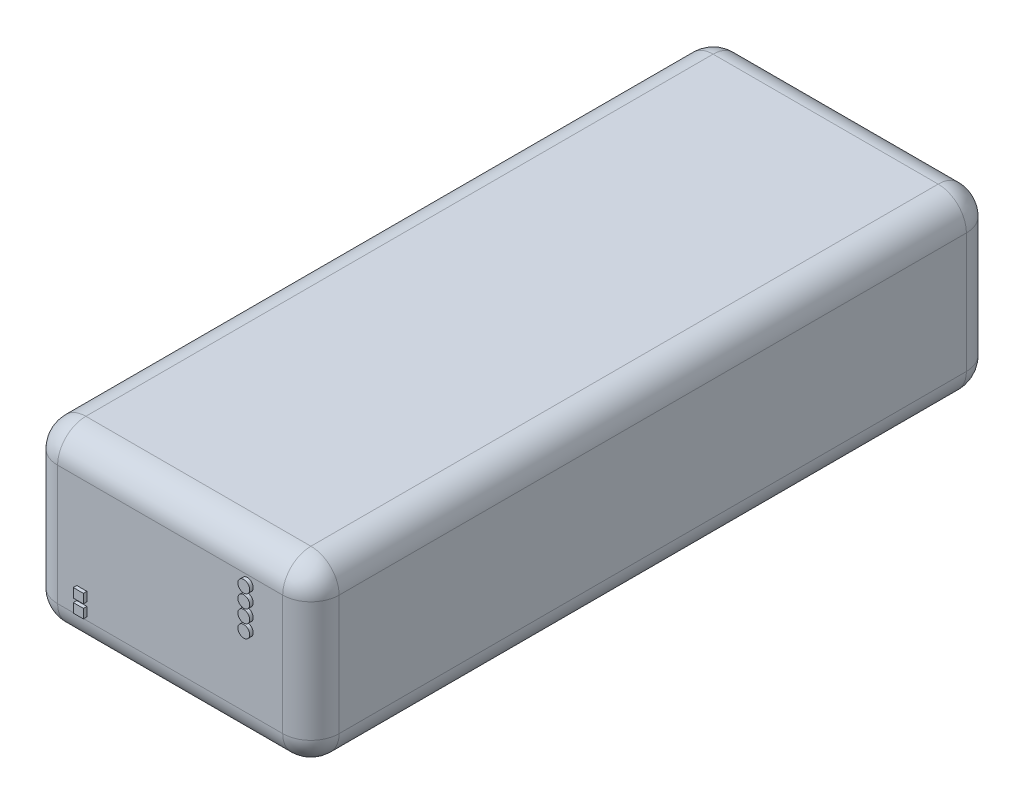
ISO-10303-21;
HEADER;
FILE_DESCRIPTION(('STEP AP214'),'2;1');
FILE_NAME('part.step','',(''),(''),'','','');
FILE_SCHEMA(('AUTOMOTIVE_DESIGN { 1 0 10303 214 1 1 1 1 }'));
ENDSEC;
DATA;
#1=APPLICATION_CONTEXT('core data for automotive mechanical design processes');
#2=APPLICATION_PROTOCOL_DEFINITION('international standard','automotive_design',2000,#1);
#3=PRODUCT_CONTEXT('',#1,'mechanical');
#4=PRODUCT('Part','Part','',(#3));
#5=PRODUCT_RELATED_PRODUCT_CATEGORY('part','',(#4));
#6=PRODUCT_DEFINITION_FORMATION('','',#4);
#7=PRODUCT_DEFINITION_CONTEXT('part definition',#1,'design');
#8=PRODUCT_DEFINITION('design','',#6,#7);
#9=PRODUCT_DEFINITION_SHAPE('','',#8);
#10=(LENGTH_UNIT() NAMED_UNIT(*) SI_UNIT(.MILLI.,.METRE.));
#11=(NAMED_UNIT(*) PLANE_ANGLE_UNIT() SI_UNIT($,.RADIAN.));
#12=(NAMED_UNIT(*) SI_UNIT($,.STERADIAN.) SOLID_ANGLE_UNIT());
#13=UNCERTAINTY_MEASURE_WITH_UNIT(LENGTH_MEASURE(1.E-05),#10,'distance_accuracy_value','');
#14=(GEOMETRIC_REPRESENTATION_CONTEXT(3) GLOBAL_UNCERTAINTY_ASSIGNED_CONTEXT((#13)) GLOBAL_UNIT_ASSIGNED_CONTEXT((#10,
#11,#12)) REPRESENTATION_CONTEXT('',''));
#15=CARTESIAN_POINT('',(0.,0.,0.));
#16=DIRECTION('',(0.,0.,1.));
#17=DIRECTION('',(1.,0.,0.));
#18=AXIS2_PLACEMENT_3D('',#15,#16,#17);
#19=CARTESIAN_POINT('',(-60.8598184671036,25.,31.1519952114924));
#20=DIRECTION('',(0.,0.,-1.));
#21=DIRECTION('',(-1.,0.,0.));
#22=AXIS2_PLACEMENT_3D('',#19,#20,#21);
#23=PLANE('',#22);
#24=DIRECTION('',(0.,-1.,0.));
#25=VECTOR('',#24,1.);
#26=CARTESIAN_POINT('',(-54.1421491003116,5.74514454988867,31.1519952114924));
#27=LINE('',#26,#25);
#28=CARTESIAN_POINT('',(-54.1421491003116,5.74514454988867,31.1519952114924));
#29=VERTEX_POINT('',#28);
#30=CARTESIAN_POINT('',(-54.1421491003116,4.44924738426584,31.1519952114924));
#31=VERTEX_POINT('',#30);
#32=EDGE_CURVE('E209',#29,#31,#27,.T.);
#33=ORIENTED_EDGE('',*,*,#32,.F.);
#34=DIRECTION('',(-1.,0.,0.));
#35=VECTOR('',#34,1.);
#36=CARTESIAN_POINT('',(-54.1421491003116,5.74514454988867,31.1519952114924));
#37=LINE('',#36,#35);
#38=CARTESIAN_POINT('',(-52.7166622181265,5.74514454988867,31.1519952114924));
#39=VERTEX_POINT('',#38);
#40=EDGE_CURVE('E214',#39,#29,#37,.T.);
#41=ORIENTED_EDGE('',*,*,#40,.F.);
#42=DIRECTION('',(0.,1.,0.));
#43=VECTOR('',#42,1.);
#44=CARTESIAN_POINT('',(-52.7166622181265,5.74514454988867,31.1519952114924));
#45=LINE('',#44,#43);
#46=CARTESIAN_POINT('',(-52.7166622181265,4.44924738426585,31.1519952114924));
#47=VERTEX_POINT('',#46);
#48=EDGE_CURVE('E226',#47,#39,#45,.T.);
#49=ORIENTED_EDGE('',*,*,#48,.F.);
#50=DIRECTION('',(1.,0.,0.));
#51=VECTOR('',#50,1.);
#52=CARTESIAN_POINT('',(-54.1421491003116,4.44924738426585,31.1519952114924));
#53=LINE('',#52,#51);
#54=EDGE_CURVE('E223',#31,#47,#53,.T.);
#55=ORIENTED_EDGE('',*,*,#54,.F.);
#56=EDGE_LOOP('',(#33,#41,#49,#55));
#57=FACE_BOUND('',#56,.T.);
#58=CARTESIAN_POINT('',(-29.9764524472873,17.9540877102445,31.1519952114924));
#59=DIRECTION('',(0.,0.,-1.));
#60=DIRECTION('',(-1.,0.,0.));
#61=AXIS2_PLACEMENT_3D('',#58,#59,#60);
#62=CIRCLE('',#61,0.836574299287982);
#63=CARTESIAN_POINT('',(-30.8130267465753,17.9540877102445,31.1519952114924));
#64=VERTEX_POINT('',#63);
#65=EDGE_CURVE('E373',#64,#64,#62,.F.);
#66=ORIENTED_EDGE('',*,*,#65,.F.);
#67=EDGE_LOOP('',(#66));
#68=FACE_BOUND('',#67,.T.);
#69=CARTESIAN_POINT('',(-29.9764524472873,19.823866424414,31.1519952114924));
#70=DIRECTION('',(0.,0.,-1.));
#71=DIRECTION('',(-1.,0.,0.));
#72=AXIS2_PLACEMENT_3D('',#69,#70,#71);
#73=CIRCLE('',#72,0.836574299287982);
#74=CARTESIAN_POINT('',(-30.8130267465753,19.823866424414,31.1519952114924));
#75=VERTEX_POINT('',#74);
#76=EDGE_CURVE('E350',#75,#75,#73,.F.);
#77=ORIENTED_EDGE('',*,*,#76,.F.);
#78=EDGE_LOOP('',(#77));
#79=FACE_BOUND('',#78,.T.);
#80=DIRECTION('',(1.,0.,0.));
#81=VECTOR('',#80,1.);
#82=CARTESIAN_POINT('',(-60.8598184671036,4.,31.1519952114924));
#83=LINE('',#82,#81);
#84=CARTESIAN_POINT('',(-56.8598184671036,4.,31.1519952114924));
#85=VERTEX_POINT('',#84);
#86=CARTESIAN_POINT('',(-24.9601635759931,4.,31.1519952114924));
#87=VERTEX_POINT('',#86);
#88=EDGE_CURVE('E252',#85,#87,#83,.T.);
#89=ORIENTED_EDGE('',*,*,#88,.T.);
#90=DIRECTION('',(0.,-1.,0.));
#91=VECTOR('',#90,1.);
#92=CARTESIAN_POINT('',(-24.9601635759931,25.,31.1519952114924));
#93=LINE('',#92,#91);
#94=CARTESIAN_POINT('',(-24.9601635759931,21.,31.1519952114924));
#95=VERTEX_POINT('',#94);
#96=EDGE_CURVE('E348',#87,#95,#93,.F.);
#97=ORIENTED_EDGE('',*,*,#96,.T.);
#98=DIRECTION('',(1.,0.,0.));
#99=VECTOR('',#98,1.);
#100=CARTESIAN_POINT('',(-60.8598184671036,21.,31.1519952114924));
#101=LINE('',#100,#99);
#102=CARTESIAN_POINT('',(-56.8598184671036,21.,31.1519952114924));
#103=VERTEX_POINT('',#102);
#104=EDGE_CURVE('E249',#95,#103,#101,.F.);
#105=ORIENTED_EDGE('',*,*,#104,.T.);
#106=DIRECTION('',(0.,-1.,0.));
#107=VECTOR('',#106,1.);
#108=CARTESIAN_POINT('',(-56.8598184671036,25.,31.1519952114924));
#109=LINE('',#108,#107);
#110=EDGE_CURVE('E346',#103,#85,#109,.T.);
#111=ORIENTED_EDGE('',*,*,#110,.T.);
#112=EDGE_LOOP('',(#89,#97,#105,#111));
#113=FACE_BOUND('',#112,.T.);
#114=CARTESIAN_POINT('',(-29.9764524472873,14.2980658429993,31.1519952114924));
#115=DIRECTION('',(0.,0.,-1.));
#116=DIRECTION('',(-1.,0.,0.));
#117=AXIS2_PLACEMENT_3D('',#114,#115,#116);
#118=CIRCLE('',#117,0.836574299287982);
#119=CARTESIAN_POINT('',(-30.8130267465753,14.2980658429993,31.1519952114924));
#120=VERTEX_POINT('',#119);
#121=EDGE_CURVE('E48',#120,#120,#118,.F.);
#122=ORIENTED_EDGE('',*,*,#121,.F.);
#123=EDGE_LOOP('',(#122));
#124=FACE_BOUND('',#123,.T.);
#125=CARTESIAN_POINT('',(-29.9764524472873,16.1447193040119,31.1519952114924));
#126=DIRECTION('',(0.,0.,-1.));
#127=DIRECTION('',(-1.,0.,0.));
#128=AXIS2_PLACEMENT_3D('',#125,#126,#127);
#129=CIRCLE('',#128,0.836574299287982);
#130=CARTESIAN_POINT('',(-30.8130267465753,16.1447193040119,31.1519952114924));
#131=VERTEX_POINT('',#130);
#132=EDGE_CURVE('E11',#131,#131,#129,.F.);
#133=ORIENTED_EDGE('',*,*,#132,.F.);
#134=EDGE_LOOP('',(#133));
#135=FACE_BOUND('',#134,.T.);
#136=DIRECTION('',(0.,-1.,0.));
#137=VECTOR('',#136,1.);
#138=CARTESIAN_POINT('',(-54.1421491003116,7.5917980109012,31.1519952114924));
#139=LINE('',#138,#137);
#140=CARTESIAN_POINT('',(-54.1421491003116,7.5917980109012,31.1519952114924));
#141=VERTEX_POINT('',#140);
#142=CARTESIAN_POINT('',(-54.1421491003116,6.29590084527837,31.1519952114924));
#143=VERTEX_POINT('',#142);
#144=EDGE_CURVE('E197',#141,#143,#139,.T.);
#145=ORIENTED_EDGE('',*,*,#144,.F.);
#146=DIRECTION('',(-1.,0.,0.));
#147=VECTOR('',#146,1.);
#148=CARTESIAN_POINT('',(-54.1421491003116,7.5917980109012,31.1519952114924));
#149=LINE('',#148,#147);
#150=CARTESIAN_POINT('',(-52.7166622181265,7.5917980109012,31.1519952114924));
#151=VERTEX_POINT('',#150);
#152=EDGE_CURVE('E194',#151,#141,#149,.T.);
#153=ORIENTED_EDGE('',*,*,#152,.F.);
#154=DIRECTION('',(0.,1.,0.));
#155=VECTOR('',#154,1.);
#156=CARTESIAN_POINT('',(-52.7166622181265,7.5917980109012,31.1519952114924));
#157=LINE('',#156,#155);
#158=CARTESIAN_POINT('',(-52.7166622181265,6.29590084527838,31.1519952114924));
#159=VERTEX_POINT('',#158);
#160=EDGE_CURVE('E60',#159,#151,#157,.T.);
#161=ORIENTED_EDGE('',*,*,#160,.F.);
#162=DIRECTION('',(1.,0.,0.));
#163=VECTOR('',#162,1.);
#164=CARTESIAN_POINT('',(-54.1421491003116,6.29590084527838,31.1519952114924));
#165=LINE('',#164,#163);
#166=EDGE_CURVE('E55',#143,#159,#165,.T.);
#167=ORIENTED_EDGE('',*,*,#166,.F.);
#168=EDGE_LOOP('',(#145,#153,#161,#167));
#169=FACE_BOUND('',#168,.T.);
#170=ADVANCED_FACE('F40',(#57,#68,#79,#113,#124,#135,#169),#23,.F.);
#171=CARTESIAN_POINT('',(-60.8598184671036,25.,-65.7471666669187));
#172=DIRECTION('',(1.,0.,0.));
#173=DIRECTION('',(0.,0.,-1.));
#174=AXIS2_PLACEMENT_3D('',#171,#172,#173);
#175=PLANE('',#174);
#176=DIRECTION('',(0.,0.,1.));
#177=VECTOR('',#176,1.);
#178=CARTESIAN_POINT('',(-60.8598184671036,21.,-65.7471666669187));
#179=LINE('',#178,#177);
#180=CARTESIAN_POINT('',(-60.8598184671036,21.,27.1519952114924));
#181=VERTEX_POINT('',#180);
#182=CARTESIAN_POINT('',(-60.8598184671036,21.,-61.7471666669187));
#183=VERTEX_POINT('',#182);
#184=EDGE_CURVE('E280',#181,#183,#179,.F.);
#185=ORIENTED_EDGE('',*,*,#184,.T.);
#186=DIRECTION('',(0.,-1.,0.));
#187=VECTOR('',#186,1.);
#188=CARTESIAN_POINT('',(-60.8598184671036,25.,-61.7471666669187));
#189=LINE('',#188,#187);
#190=CARTESIAN_POINT('',(-60.8598184671036,4.,-61.7471666669187));
#191=VERTEX_POINT('',#190);
#192=EDGE_CURVE('E336',#183,#191,#189,.T.);
#193=ORIENTED_EDGE('',*,*,#192,.T.);
#194=DIRECTION('',(0.,0.,1.));
#195=VECTOR('',#194,1.);
#196=CARTESIAN_POINT('',(-60.8598184671036,4.,-65.7471666669187));
#197=LINE('',#196,#195);
#198=CARTESIAN_POINT('',(-60.8598184671036,4.,27.1519952114924));
#199=VERTEX_POINT('',#198);
#200=EDGE_CURVE('E283',#191,#199,#197,.T.);
#201=ORIENTED_EDGE('',*,*,#200,.T.);
#202=DIRECTION('',(0.,-1.,0.));
#203=VECTOR('',#202,1.);
#204=CARTESIAN_POINT('',(-60.8598184671036,25.,27.1519952114924));
#205=LINE('',#204,#203);
#206=EDGE_CURVE('E334',#199,#181,#205,.F.);
#207=ORIENTED_EDGE('',*,*,#206,.T.);
#208=EDGE_LOOP('',(#185,#193,#201,#207));
#209=FACE_BOUND('',#208,.T.);
#210=ADVANCED_FACE('F382',(#209),#175,.F.);
#211=CARTESIAN_POINT('',(-20.9601635759931,25.,-65.7471666669187));
#212=DIRECTION('',(-1.,0.,0.));
#213=DIRECTION('',(0.,0.,1.));
#214=AXIS2_PLACEMENT_3D('',#211,#212,#213);
#215=PLANE('',#214);
#216=DIRECTION('',(0.,0.,-1.));
#217=VECTOR('',#216,1.);
#218=CARTESIAN_POINT('',(-20.9601635759931,4.,-65.7471666669187));
#219=LINE('',#218,#217);
#220=CARTESIAN_POINT('',(-20.9601635759931,4.,27.1519952114924));
#221=VERTEX_POINT('',#220);
#222=CARTESIAN_POINT('',(-20.9601635759931,4.,-61.7471666669187));
#223=VERTEX_POINT('',#222);
#224=EDGE_CURVE('E271',#221,#223,#219,.T.);
#225=ORIENTED_EDGE('',*,*,#224,.T.);
#226=DIRECTION('',(0.,-1.,0.));
#227=VECTOR('',#226,1.);
#228=CARTESIAN_POINT('',(-20.9601635759931,25.,-61.7471666669187));
#229=LINE('',#228,#227);
#230=CARTESIAN_POINT('',(-20.9601635759931,21.,-61.7471666669187));
#231=VERTEX_POINT('',#230);
#232=EDGE_CURVE('E344',#223,#231,#229,.F.);
#233=ORIENTED_EDGE('',*,*,#232,.T.);
#234=DIRECTION('',(0.,0.,-1.));
#235=VECTOR('',#234,1.);
#236=CARTESIAN_POINT('',(-20.9601635759931,21.,31.1519952114924));
#237=LINE('',#236,#235);
#238=CARTESIAN_POINT('',(-20.9601635759931,21.,27.1519952114924));
#239=VERTEX_POINT('',#238);
#240=EDGE_CURVE('E268',#231,#239,#237,.F.);
#241=ORIENTED_EDGE('',*,*,#240,.T.);
#242=DIRECTION('',(0.,-1.,0.));
#243=VECTOR('',#242,1.);
#244=CARTESIAN_POINT('',(-20.9601635759931,25.,27.1519952114924));
#245=LINE('',#244,#243);
#246=EDGE_CURVE('E342',#239,#221,#245,.T.);
#247=ORIENTED_EDGE('',*,*,#246,.T.);
#248=EDGE_LOOP('',(#225,#233,#241,#247));
#249=FACE_BOUND('',#248,.T.);
#250=ADVANCED_FACE('F477',(#249),#215,.F.);
#251=CARTESIAN_POINT('',(-60.8598184671036,25.,-65.7471666669187));
#252=DIRECTION('',(0.,0.,1.));
#253=DIRECTION('',(1.,0.,0.));
#254=AXIS2_PLACEMENT_3D('',#251,#252,#253);
#255=PLANE('',#254);
#256=DIRECTION('',(-1.,0.,0.));
#257=VECTOR('',#256,1.);
#258=CARTESIAN_POINT('',(-60.8598184671036,4.,-65.7471666669187));
#259=LINE('',#258,#257);
#260=CARTESIAN_POINT('',(-24.9601635759931,4.,-65.7471666669187));
#261=VERTEX_POINT('',#260);
#262=CARTESIAN_POINT('',(-56.8598184671036,4.,-65.7471666669187));
#263=VERTEX_POINT('',#262);
#264=EDGE_CURVE('E277',#261,#263,#259,.T.);
#265=ORIENTED_EDGE('',*,*,#264,.T.);
#266=DIRECTION('',(0.,-1.,0.));
#267=VECTOR('',#266,1.);
#268=CARTESIAN_POINT('',(-56.8598184671036,25.,-65.7471666669187));
#269=LINE('',#268,#267);
#270=CARTESIAN_POINT('',(-56.8598184671036,21.,-65.7471666669187));
#271=VERTEX_POINT('',#270);
#272=EDGE_CURVE('E340',#263,#271,#269,.F.);
#273=ORIENTED_EDGE('',*,*,#272,.T.);
#274=DIRECTION('',(-1.,0.,0.));
#275=VECTOR('',#274,1.);
#276=CARTESIAN_POINT('',(-20.9601635759931,21.,-65.7471666669187));
#277=LINE('',#276,#275);
#278=CARTESIAN_POINT('',(-24.9601635759931,21.,-65.7471666669187));
#279=VERTEX_POINT('',#278);
#280=EDGE_CURVE('E274',#271,#279,#277,.F.);
#281=ORIENTED_EDGE('',*,*,#280,.T.);
#282=DIRECTION('',(0.,-1.,0.));
#283=VECTOR('',#282,1.);
#284=CARTESIAN_POINT('',(-24.9601635759931,25.,-65.7471666669187));
#285=LINE('',#284,#283);
#286=EDGE_CURVE('E338',#279,#261,#285,.T.);
#287=ORIENTED_EDGE('',*,*,#286,.T.);
#288=EDGE_LOOP('',(#265,#273,#281,#287));
#289=FACE_BOUND('',#288,.T.);
#290=ADVANCED_FACE('F469',(#289),#255,.F.);
#291=CARTESIAN_POINT('',(0.,25.,0.));
#292=DIRECTION('',(0.,1.,0.));
#293=DIRECTION('',(0.,0.,1.));
#294=AXIS2_PLACEMENT_3D('',#291,#292,#293);
#295=PLANE('',#294);
#296=DIRECTION('',(0.,0.,-1.));
#297=VECTOR('',#296,1.);
#298=CARTESIAN_POINT('',(-24.9601635759931,25.,-65.7471666669187));
#299=LINE('',#298,#297);
#300=CARTESIAN_POINT('',(-24.9601635759931,25.,27.1519952114924));
#301=VERTEX_POINT('',#300);
#302=CARTESIAN_POINT('',(-24.9601635759931,25.,-61.7471666669187));
#303=VERTEX_POINT('',#302);
#304=EDGE_CURVE('E292',#301,#303,#299,.T.);
#305=ORIENTED_EDGE('',*,*,#304,.T.);
#306=DIRECTION('',(-1.,0.,0.));
#307=VECTOR('',#306,1.);
#308=CARTESIAN_POINT('',(-60.8598184671036,25.,-61.7471666669187));
#309=LINE('',#308,#307);
#310=CARTESIAN_POINT('',(-56.8598184671036,25.,-61.7471666669187));
#311=VERTEX_POINT('',#310);
#312=EDGE_CURVE('E295',#303,#311,#309,.T.);
#313=ORIENTED_EDGE('',*,*,#312,.T.);
#314=DIRECTION('',(0.,0.,1.));
#315=VECTOR('',#314,1.);
#316=CARTESIAN_POINT('',(-56.8598184671036,25.,31.1519952114924));
#317=LINE('',#316,#315);
#318=CARTESIAN_POINT('',(-56.8598184671036,25.,27.1519952114924));
#319=VERTEX_POINT('',#318);
#320=EDGE_CURVE('E286',#311,#319,#317,.T.);
#321=ORIENTED_EDGE('',*,*,#320,.T.);
#322=DIRECTION('',(1.,0.,0.));
#323=VECTOR('',#322,1.);
#324=CARTESIAN_POINT('',(-20.9601635759931,25.,27.1519952114924));
#325=LINE('',#324,#323);
#326=EDGE_CURVE('E289',#319,#301,#325,.T.);
#327=ORIENTED_EDGE('',*,*,#326,.T.);
#328=EDGE_LOOP('',(#305,#313,#321,#327));
#329=FACE_BOUND('',#328,.T.);
#330=ADVANCED_FACE('F465',(#329),#295,.T.);
#331=CARTESIAN_POINT('',(0.,0.,0.));
#332=DIRECTION('',(0.,1.,0.));
#333=DIRECTION('',(0.,0.,1.));
#334=AXIS2_PLACEMENT_3D('',#331,#332,#333);
#335=PLANE('',#334);
#336=DIRECTION('',(0.,0.,-1.));
#337=VECTOR('',#336,1.);
#338=CARTESIAN_POINT('',(-24.9601635759931,0.,0.));
#339=LINE('',#338,#337);
#340=CARTESIAN_POINT('',(-24.9601635759931,0.,-61.7471666669187));
#341=VERTEX_POINT('',#340);
#342=CARTESIAN_POINT('',(-24.9601635759931,0.,27.1519952114924));
#343=VERTEX_POINT('',#342);
#344=EDGE_CURVE('E262',#341,#343,#339,.F.);
#345=ORIENTED_EDGE('',*,*,#344,.T.);
#346=DIRECTION('',(1.,0.,0.));
#347=VECTOR('',#346,1.);
#348=CARTESIAN_POINT('',(0.,0.,27.1519952114924));
#349=LINE('',#348,#347);
#350=CARTESIAN_POINT('',(-56.8598184671036,0.,27.1519952114924));
#351=VERTEX_POINT('',#350);
#352=EDGE_CURVE('E265',#343,#351,#349,.F.);
#353=ORIENTED_EDGE('',*,*,#352,.T.);
#354=DIRECTION('',(0.,0.,1.));
#355=VECTOR('',#354,1.);
#356=CARTESIAN_POINT('',(-56.8598184671036,0.,0.));
#357=LINE('',#356,#355);
#358=CARTESIAN_POINT('',(-56.8598184671036,0.,-61.7471666669187));
#359=VERTEX_POINT('',#358);
#360=EDGE_CURVE('E256',#351,#359,#357,.F.);
#361=ORIENTED_EDGE('',*,*,#360,.T.);
#362=DIRECTION('',(-1.,0.,0.));
#363=VECTOR('',#362,1.);
#364=CARTESIAN_POINT('',(0.,0.,-61.7471666669187));
#365=LINE('',#364,#363);
#366=EDGE_CURVE('E259',#359,#341,#365,.F.);
#367=ORIENTED_EDGE('',*,*,#366,.T.);
#368=EDGE_LOOP('',(#345,#353,#361,#367));
#369=FACE_BOUND('',#368,.T.);
#370=ADVANCED_FACE('F468',(#369),#335,.F.);
#371=CARTESIAN_POINT('',(-60.8598184671036,4.,-61.7471666669187));
#372=DIRECTION('',(-1.,0.,0.));
#373=DIRECTION('',(0.,0.,1.));
#374=AXIS2_PLACEMENT_3D('',#371,#372,#373);
#375=CYLINDRICAL_SURFACE('',#374,4.);
#376=ORIENTED_EDGE('',*,*,#366,.F.);
#377=CARTESIAN_POINT('',(-56.8598184671036,4.,-61.7471666669187));
#378=DIRECTION('',(-1.,0.,0.));
#379=DIRECTION('',(0.,0.,1.));
#380=AXIS2_PLACEMENT_3D('',#377,#378,#379);
#381=CIRCLE('',#380,4.);
#382=EDGE_CURVE('E315',#359,#263,#381,.F.);
#383=ORIENTED_EDGE('',*,*,#382,.T.);
#384=ORIENTED_EDGE('',*,*,#264,.F.);
#385=CARTESIAN_POINT('',(-24.9601635759931,4.,-61.7471666669187));
#386=DIRECTION('',(-1.,0.,0.));
#387=DIRECTION('',(0.,0.,1.));
#388=AXIS2_PLACEMENT_3D('',#385,#386,#387);
#389=CIRCLE('',#388,4.);
#390=EDGE_CURVE('E313',#261,#341,#389,.T.);
#391=ORIENTED_EDGE('',*,*,#390,.T.);
#392=EDGE_LOOP('',(#376,#383,#384,#391));
#393=FACE_BOUND('',#392,.T.);
#394=ADVANCED_FACE('F473',(#393),#375,.T.);
#395=CARTESIAN_POINT('',(-56.8598184671036,4.,-65.7471666669187));
#396=DIRECTION('',(0.,0.,1.));
#397=DIRECTION('',(1.,0.,0.));
#398=AXIS2_PLACEMENT_3D('',#395,#396,#397);
#399=CYLINDRICAL_SURFACE('',#398,4.);
#400=ORIENTED_EDGE('',*,*,#200,.F.);
#401=CARTESIAN_POINT('',(-56.8598184671036,4.,-61.7471666669187));
#402=DIRECTION('',(0.,0.,1.));
#403=DIRECTION('',(1.,0.,0.));
#404=AXIS2_PLACEMENT_3D('',#401,#402,#403);
#405=CIRCLE('',#404,4.);
#406=EDGE_CURVE('E311',#191,#359,#405,.T.);
#407=ORIENTED_EDGE('',*,*,#406,.T.);
#408=ORIENTED_EDGE('',*,*,#360,.F.);
#409=CARTESIAN_POINT('',(-56.8598184671036,4.,27.1519952114924));
#410=DIRECTION('',(0.,0.,1.));
#411=DIRECTION('',(1.,0.,0.));
#412=AXIS2_PLACEMENT_3D('',#409,#410,#411);
#413=CIRCLE('',#412,4.);
#414=EDGE_CURVE('E309',#351,#199,#413,.F.);
#415=ORIENTED_EDGE('',*,*,#414,.T.);
#416=EDGE_LOOP('',(#400,#407,#408,#415));
#417=FACE_BOUND('',#416,.T.);
#418=ADVANCED_FACE('F493',(#417),#399,.T.);
#419=CARTESIAN_POINT('',(-24.9601635759931,4.,-65.7471666669187));
#420=DIRECTION('',(0.,0.,-1.));
#421=DIRECTION('',(-1.,0.,0.));
#422=AXIS2_PLACEMENT_3D('',#419,#420,#421);
#423=CYLINDRICAL_SURFACE('',#422,4.);
#424=ORIENTED_EDGE('',*,*,#344,.F.);
#425=CARTESIAN_POINT('',(-24.9601635759931,4.,-61.7471666669187));
#426=DIRECTION('',(0.,0.,-1.));
#427=DIRECTION('',(-1.,0.,0.));
#428=AXIS2_PLACEMENT_3D('',#425,#426,#427);
#429=CIRCLE('',#428,4.);
#430=EDGE_CURVE('E324',#341,#223,#429,.F.);
#431=ORIENTED_EDGE('',*,*,#430,.T.);
#432=ORIENTED_EDGE('',*,*,#224,.F.);
#433=CARTESIAN_POINT('',(-24.9601635759931,4.,27.1519952114924));
#434=DIRECTION('',(0.,0.,-1.));
#435=DIRECTION('',(-1.,0.,0.));
#436=AXIS2_PLACEMENT_3D('',#433,#434,#435);
#437=CIRCLE('',#436,4.);
#438=EDGE_CURVE('E322',#221,#343,#437,.T.);
#439=ORIENTED_EDGE('',*,*,#438,.T.);
#440=EDGE_LOOP('',(#424,#431,#432,#439));
#441=FACE_BOUND('',#440,.T.);
#442=ADVANCED_FACE('F489',(#441),#423,.T.);
#443=CARTESIAN_POINT('',(-60.8598184671036,4.,27.1519952114924));
#444=DIRECTION('',(1.,0.,0.));
#445=DIRECTION('',(0.,0.,-1.));
#446=AXIS2_PLACEMENT_3D('',#443,#444,#445);
#447=CYLINDRICAL_SURFACE('',#446,4.);
#448=ORIENTED_EDGE('',*,*,#352,.F.);
#449=CARTESIAN_POINT('',(-24.9601635759931,4.,27.1519952114924));
#450=DIRECTION('',(1.,0.,0.));
#451=DIRECTION('',(0.,0.,-1.));
#452=AXIS2_PLACEMENT_3D('',#449,#450,#451);
#453=CIRCLE('',#452,4.);
#454=EDGE_CURVE('E332',#343,#87,#453,.F.);
#455=ORIENTED_EDGE('',*,*,#454,.T.);
#456=ORIENTED_EDGE('',*,*,#88,.F.);
#457=CARTESIAN_POINT('',(-56.8598184671036,4.,27.1519952114924));
#458=DIRECTION('',(1.,0.,0.));
#459=DIRECTION('',(0.,0.,-1.));
#460=AXIS2_PLACEMENT_3D('',#457,#458,#459);
#461=CIRCLE('',#460,4.);
#462=EDGE_CURVE('E330',#85,#351,#461,.T.);
#463=ORIENTED_EDGE('',*,*,#462,.T.);
#464=EDGE_LOOP('',(#448,#455,#456,#463));
#465=FACE_BOUND('',#464,.T.);
#466=ADVANCED_FACE('F485',(#465),#447,.T.);
#467=CARTESIAN_POINT('',(0.,21.,27.1519952114924));
#468=DIRECTION('',(-1.,0.,0.));
#469=DIRECTION('',(0.,0.,1.));
#470=AXIS2_PLACEMENT_3D('',#467,#468,#469);
#471=CYLINDRICAL_SURFACE('',#470,4.);
#472=ORIENTED_EDGE('',*,*,#104,.F.);
#473=CARTESIAN_POINT('',(-24.9601635759931,21.,27.1519952114924));
#474=DIRECTION('',(-1.,0.,0.));
#475=DIRECTION('',(0.,0.,1.));
#476=AXIS2_PLACEMENT_3D('',#473,#474,#475);
#477=CIRCLE('',#476,4.);
#478=EDGE_CURVE('E328',#95,#301,#477,.T.);
#479=ORIENTED_EDGE('',*,*,#478,.T.);
#480=ORIENTED_EDGE('',*,*,#326,.F.);
#481=CARTESIAN_POINT('',(-56.8598184671036,21.,27.1519952114924));
#482=DIRECTION('',(-1.,0.,0.));
#483=DIRECTION('',(0.,0.,1.));
#484=AXIS2_PLACEMENT_3D('',#481,#482,#483);
#485=CIRCLE('',#484,4.);
#486=EDGE_CURVE('E326',#319,#103,#485,.F.);
#487=ORIENTED_EDGE('',*,*,#486,.T.);
#488=EDGE_LOOP('',(#472,#479,#480,#487));
#489=FACE_BOUND('',#488,.T.);
#490=ADVANCED_FACE('F488',(#489),#471,.T.);
#491=CARTESIAN_POINT('',(-24.9601635759931,21.,0.));
#492=DIRECTION('',(0.,0.,1.));
#493=DIRECTION('',(1.,0.,0.));
#494=AXIS2_PLACEMENT_3D('',#491,#492,#493);
#495=CYLINDRICAL_SURFACE('',#494,4.);
#496=ORIENTED_EDGE('',*,*,#240,.F.);
#497=CARTESIAN_POINT('',(-24.9601635759931,21.,-61.7471666669187));
#498=DIRECTION('',(0.,0.,1.));
#499=DIRECTION('',(1.,0.,0.));
#500=AXIS2_PLACEMENT_3D('',#497,#498,#499);
#501=CIRCLE('',#500,4.);
#502=EDGE_CURVE('E320',#231,#303,#501,.T.);
#503=ORIENTED_EDGE('',*,*,#502,.T.);
#504=ORIENTED_EDGE('',*,*,#304,.F.);
#505=CARTESIAN_POINT('',(-24.9601635759931,21.,27.1519952114924));
#506=DIRECTION('',(0.,0.,1.));
#507=DIRECTION('',(1.,0.,0.));
#508=AXIS2_PLACEMENT_3D('',#505,#506,#507);
#509=CIRCLE('',#508,4.);
#510=EDGE_CURVE('E317',#301,#239,#509,.F.);
#511=ORIENTED_EDGE('',*,*,#510,.T.);
#512=EDGE_LOOP('',(#496,#503,#504,#511));
#513=FACE_BOUND('',#512,.T.);
#514=ADVANCED_FACE('F509',(#513),#495,.T.);
#515=CARTESIAN_POINT('',(-56.8598184671036,21.,0.));
#516=DIRECTION('',(0.,0.,-1.));
#517=DIRECTION('',(-1.,0.,0.));
#518=AXIS2_PLACEMENT_3D('',#515,#516,#517);
#519=CYLINDRICAL_SURFACE('',#518,4.);
#520=ORIENTED_EDGE('',*,*,#320,.F.);
#521=CARTESIAN_POINT('',(-56.8598184671036,21.,-61.7471666669187));
#522=DIRECTION('',(0.,0.,-1.));
#523=DIRECTION('',(-1.,0.,0.));
#524=AXIS2_PLACEMENT_3D('',#521,#522,#523);
#525=CIRCLE('',#524,4.);
#526=EDGE_CURVE('E307',#311,#183,#525,.F.);
#527=ORIENTED_EDGE('',*,*,#526,.T.);
#528=ORIENTED_EDGE('',*,*,#184,.F.);
#529=CARTESIAN_POINT('',(-56.8598184671036,21.,27.1519952114924));
#530=DIRECTION('',(0.,0.,-1.));
#531=DIRECTION('',(-1.,0.,0.));
#532=AXIS2_PLACEMENT_3D('',#529,#530,#531);
#533=CIRCLE('',#532,4.);
#534=EDGE_CURVE('E304',#181,#319,#533,.T.);
#535=ORIENTED_EDGE('',*,*,#534,.T.);
#536=EDGE_LOOP('',(#520,#527,#528,#535));
#537=FACE_BOUND('',#536,.T.);
#538=ADVANCED_FACE('F505',(#537),#519,.T.);
#539=CARTESIAN_POINT('',(0.,21.,-61.7471666669187));
#540=DIRECTION('',(1.,0.,0.));
#541=DIRECTION('',(0.,0.,-1.));
#542=AXIS2_PLACEMENT_3D('',#539,#540,#541);
#543=CYLINDRICAL_SURFACE('',#542,4.);
#544=ORIENTED_EDGE('',*,*,#280,.F.);
#545=CARTESIAN_POINT('',(-56.8598184671036,21.,-61.7471666669187));
#546=DIRECTION('',(1.,0.,0.));
#547=DIRECTION('',(0.,0.,-1.));
#548=AXIS2_PLACEMENT_3D('',#545,#546,#547);
#549=CIRCLE('',#548,4.);
#550=EDGE_CURVE('E301',#271,#311,#549,.T.);
#551=ORIENTED_EDGE('',*,*,#550,.T.);
#552=ORIENTED_EDGE('',*,*,#312,.F.);
#553=CARTESIAN_POINT('',(-24.9601635759931,21.,-61.7471666669187));
#554=DIRECTION('',(1.,0.,0.));
#555=DIRECTION('',(0.,0.,-1.));
#556=AXIS2_PLACEMENT_3D('',#553,#554,#555);
#557=CIRCLE('',#556,4.);
#558=EDGE_CURVE('E298',#303,#279,#557,.F.);
#559=ORIENTED_EDGE('',*,*,#558,.T.);
#560=EDGE_LOOP('',(#544,#551,#552,#559));
#561=FACE_BOUND('',#560,.T.);
#562=ADVANCED_FACE('F501',(#561),#543,.T.);
#563=CARTESIAN_POINT('',(-56.8598184671036,4.,-61.7471666669187));
#564=DIRECTION('',(0.,0.,1.));
#565=DIRECTION('',(1.,0.,0.));
#566=AXIS2_PLACEMENT_3D('',#563,#564,#565);
#567=SPHERICAL_SURFACE('',#566,4.);
#568=ORIENTED_EDGE('',*,*,#382,.F.);
#569=ORIENTED_EDGE('',*,*,#406,.F.);
#570=CARTESIAN_POINT('',(-56.8598184671036,4.,-61.7471666669187));
#571=DIRECTION('',(0.,1.,0.));
#572=DIRECTION('',(0.,0.,1.));
#573=AXIS2_PLACEMENT_3D('',#570,#571,#572);
#574=CIRCLE('',#573,4.);
#575=EDGE_CURVE('E253',#263,#191,#574,.T.);
#576=ORIENTED_EDGE('',*,*,#575,.F.);
#577=EDGE_LOOP('',(#568,#569,#576));
#578=FACE_BOUND('',#577,.T.);
#579=ADVANCED_FACE('F504',(#578),#567,.T.);
#580=CARTESIAN_POINT('',(-56.8598184671036,25.,-61.7471666669187));
#581=DIRECTION('',(0.,-1.,0.));
#582=DIRECTION('',(0.,0.,-1.));
#583=AXIS2_PLACEMENT_3D('',#580,#581,#582);
#584=CYLINDRICAL_SURFACE('',#583,4.);
#585=ORIENTED_EDGE('',*,*,#575,.T.);
#586=ORIENTED_EDGE('',*,*,#192,.F.);
#587=CARTESIAN_POINT('',(-56.8598184671036,21.,-61.7471666669187));
#588=DIRECTION('',(0.,1.,0.));
#589=DIRECTION('',(0.,0.,1.));
#590=AXIS2_PLACEMENT_3D('',#587,#588,#589);
#591=CIRCLE('',#590,4.);
#592=EDGE_CURVE('E351',#271,#183,#591,.T.);
#593=ORIENTED_EDGE('',*,*,#592,.F.);
#594=ORIENTED_EDGE('',*,*,#272,.F.);
#595=EDGE_LOOP('',(#585,#586,#593,#594));
#596=FACE_BOUND('',#595,.T.);
#597=ADVANCED_FACE('F521',(#596),#584,.T.);
#598=CARTESIAN_POINT('',(-56.8598184671036,21.,-61.7471666669187));
#599=DIRECTION('',(0.,0.,1.));
#600=DIRECTION('',(1.,0.,0.));
#601=AXIS2_PLACEMENT_3D('',#598,#599,#600);
#602=SPHERICAL_SURFACE('',#601,4.);
#603=ORIENTED_EDGE('',*,*,#592,.T.);
#604=ORIENTED_EDGE('',*,*,#526,.F.);
#605=ORIENTED_EDGE('',*,*,#550,.F.);
#606=EDGE_LOOP('',(#603,#604,#605));
#607=FACE_BOUND('',#606,.T.);
#608=ADVANCED_FACE('F517',(#607),#602,.T.);
#609=CARTESIAN_POINT('',(-24.9601635759931,4.,-61.7471666669187));
#610=DIRECTION('',(0.,0.,1.));
#611=DIRECTION('',(1.,0.,0.));
#612=AXIS2_PLACEMENT_3D('',#609,#610,#611);
#613=SPHERICAL_SURFACE('',#612,4.);
#614=ORIENTED_EDGE('',*,*,#430,.F.);
#615=ORIENTED_EDGE('',*,*,#390,.F.);
#616=CARTESIAN_POINT('',(-24.9601635759931,4.,-61.7471666669187));
#617=DIRECTION('',(0.,1.,0.));
#618=DIRECTION('',(0.,0.,1.));
#619=AXIS2_PLACEMENT_3D('',#616,#617,#618);
#620=CIRCLE('',#619,4.);
#621=EDGE_CURVE('E354',#223,#261,#620,.T.);
#622=ORIENTED_EDGE('',*,*,#621,.F.);
#623=EDGE_LOOP('',(#614,#615,#622));
#624=FACE_BOUND('',#623,.T.);
#625=ADVANCED_FACE('F520',(#624),#613,.T.);
#626=CARTESIAN_POINT('',(-24.9601635759931,25.,-61.7471666669187));
#627=DIRECTION('',(0.,-1.,0.));
#628=DIRECTION('',(0.,0.,-1.));
#629=AXIS2_PLACEMENT_3D('',#626,#627,#628);
#630=CYLINDRICAL_SURFACE('',#629,4.);
#631=ORIENTED_EDGE('',*,*,#621,.T.);
#632=ORIENTED_EDGE('',*,*,#286,.F.);
#633=CARTESIAN_POINT('',(-24.9601635759931,21.,-61.7471666669187));
#634=DIRECTION('',(0.,1.,0.));
#635=DIRECTION('',(0.,0.,1.));
#636=AXIS2_PLACEMENT_3D('',#633,#634,#635);
#637=CIRCLE('',#636,4.);
#638=EDGE_CURVE('E357',#231,#279,#637,.T.);
#639=ORIENTED_EDGE('',*,*,#638,.F.);
#640=ORIENTED_EDGE('',*,*,#232,.F.);
#641=EDGE_LOOP('',(#631,#632,#639,#640));
#642=FACE_BOUND('',#641,.T.);
#643=ADVANCED_FACE('F533',(#642),#630,.T.);
#644=CARTESIAN_POINT('',(-24.9601635759931,21.,-61.7471666669187));
#645=DIRECTION('',(0.,0.,1.));
#646=DIRECTION('',(1.,0.,0.));
#647=AXIS2_PLACEMENT_3D('',#644,#645,#646);
#648=SPHERICAL_SURFACE('',#647,4.);
#649=ORIENTED_EDGE('',*,*,#558,.F.);
#650=ORIENTED_EDGE('',*,*,#502,.F.);
#651=ORIENTED_EDGE('',*,*,#638,.T.);
#652=EDGE_LOOP('',(#649,#650,#651));
#653=FACE_BOUND('',#652,.T.);
#654=ADVANCED_FACE('F529',(#653),#648,.T.);
#655=CARTESIAN_POINT('',(-24.9601635759931,4.,27.1519952114924));
#656=DIRECTION('',(0.,0.,1.));
#657=DIRECTION('',(1.,0.,0.));
#658=AXIS2_PLACEMENT_3D('',#655,#656,#657);
#659=SPHERICAL_SURFACE('',#658,4.);
#660=ORIENTED_EDGE('',*,*,#454,.F.);
#661=ORIENTED_EDGE('',*,*,#438,.F.);
#662=CARTESIAN_POINT('',(-24.9601635759931,4.,27.1519952114924));
#663=DIRECTION('',(0.,1.,0.));
#664=DIRECTION('',(0.,0.,1.));
#665=AXIS2_PLACEMENT_3D('',#662,#663,#664);
#666=CIRCLE('',#665,4.);
#667=EDGE_CURVE('E359',#87,#221,#666,.T.);
#668=ORIENTED_EDGE('',*,*,#667,.F.);
#669=EDGE_LOOP('',(#660,#661,#668));
#670=FACE_BOUND('',#669,.T.);
#671=ADVANCED_FACE('F532',(#670),#659,.T.);
#672=CARTESIAN_POINT('',(-24.9601635759931,25.,27.1519952114924));
#673=DIRECTION('',(0.,-1.,0.));
#674=DIRECTION('',(0.,0.,-1.));
#675=AXIS2_PLACEMENT_3D('',#672,#673,#674);
#676=CYLINDRICAL_SURFACE('',#675,4.);
#677=ORIENTED_EDGE('',*,*,#667,.T.);
#678=ORIENTED_EDGE('',*,*,#246,.F.);
#679=CARTESIAN_POINT('',(-24.9601635759931,21.,27.1519952114924));
#680=DIRECTION('',(0.,1.,0.));
#681=DIRECTION('',(0.,0.,1.));
#682=AXIS2_PLACEMENT_3D('',#679,#680,#681);
#683=CIRCLE('',#682,4.);
#684=EDGE_CURVE('E362',#95,#239,#683,.T.);
#685=ORIENTED_EDGE('',*,*,#684,.F.);
#686=ORIENTED_EDGE('',*,*,#96,.F.);
#687=EDGE_LOOP('',(#677,#678,#685,#686));
#688=FACE_BOUND('',#687,.T.);
#689=ADVANCED_FACE('F544',(#688),#676,.T.);
#690=CARTESIAN_POINT('',(-24.9601635759931,21.,27.1519952114924));
#691=DIRECTION('',(0.,0.,1.));
#692=DIRECTION('',(1.,0.,0.));
#693=AXIS2_PLACEMENT_3D('',#690,#691,#692);
#694=SPHERICAL_SURFACE('',#693,4.);
#695=ORIENTED_EDGE('',*,*,#510,.F.);
#696=ORIENTED_EDGE('',*,*,#478,.F.);
#697=ORIENTED_EDGE('',*,*,#684,.T.);
#698=EDGE_LOOP('',(#695,#696,#697));
#699=FACE_BOUND('',#698,.T.);
#700=ADVANCED_FACE('F541',(#699),#694,.T.);
#701=CARTESIAN_POINT('',(-56.8598184671036,4.,27.1519952114924));
#702=DIRECTION('',(0.,0.,1.));
#703=DIRECTION('',(1.,0.,0.));
#704=AXIS2_PLACEMENT_3D('',#701,#702,#703);
#705=SPHERICAL_SURFACE('',#704,4.);
#706=ORIENTED_EDGE('',*,*,#414,.F.);
#707=ORIENTED_EDGE('',*,*,#462,.F.);
#708=CARTESIAN_POINT('',(-56.8598184671036,4.,27.1519952114924));
#709=DIRECTION('',(0.,1.,0.));
#710=DIRECTION('',(0.,0.,1.));
#711=AXIS2_PLACEMENT_3D('',#708,#709,#710);
#712=CIRCLE('',#711,4.);
#713=EDGE_CURVE('E364',#199,#85,#712,.T.);
#714=ORIENTED_EDGE('',*,*,#713,.F.);
#715=EDGE_LOOP('',(#706,#707,#714));
#716=FACE_BOUND('',#715,.T.);
#717=ADVANCED_FACE('F42',(#716),#705,.T.);
#718=CARTESIAN_POINT('',(-56.8598184671036,25.,27.1519952114924));
#719=DIRECTION('',(0.,-1.,0.));
#720=DIRECTION('',(0.,0.,-1.));
#721=AXIS2_PLACEMENT_3D('',#718,#719,#720);
#722=CYLINDRICAL_SURFACE('',#721,4.);
#723=ORIENTED_EDGE('',*,*,#713,.T.);
#724=ORIENTED_EDGE('',*,*,#110,.F.);
#725=CARTESIAN_POINT('',(-56.8598184671036,21.,27.1519952114924));
#726=DIRECTION('',(0.,1.,0.));
#727=DIRECTION('',(0.,0.,1.));
#728=AXIS2_PLACEMENT_3D('',#725,#726,#727);
#729=CIRCLE('',#728,4.);
#730=EDGE_CURVE('E248',#181,#103,#729,.T.);
#731=ORIENTED_EDGE('',*,*,#730,.F.);
#732=ORIENTED_EDGE('',*,*,#206,.F.);
#733=EDGE_LOOP('',(#723,#724,#731,#732));
#734=FACE_BOUND('',#733,.T.);
#735=ADVANCED_FACE('F553',(#734),#722,.T.);
#736=CARTESIAN_POINT('',(-56.8598184671036,21.,27.1519952114924));
#737=DIRECTION('',(0.,0.,1.));
#738=DIRECTION('',(1.,0.,0.));
#739=AXIS2_PLACEMENT_3D('',#736,#737,#738);
#740=SPHERICAL_SURFACE('',#739,4.);
#741=ORIENTED_EDGE('',*,*,#730,.T.);
#742=ORIENTED_EDGE('',*,*,#486,.F.);
#743=ORIENTED_EDGE('',*,*,#534,.F.);
#744=EDGE_LOOP('',(#741,#742,#743));
#745=FACE_BOUND('',#744,.T.);
#746=ADVANCED_FACE('F463',(#745),#740,.T.);
#747=CARTESIAN_POINT('',(-29.9764524472873,19.823866424414,31.6519952114924));
#748=DIRECTION('',(0.,0.,-1.));
#749=DIRECTION('',(-1.,0.,0.));
#750=AXIS2_PLACEMENT_3D('',#747,#748,#749);
#751=CYLINDRICAL_SURFACE('',#750,0.836574299287982);
#752=CARTESIAN_POINT('',(-29.9764524472873,19.823866424414,31.6519952114924));
#753=DIRECTION('',(0.,0.,1.));
#754=DIRECTION('',(1.,0.,0.));
#755=AXIS2_PLACEMENT_3D('',#752,#753,#754);
#756=CIRCLE('',#755,0.836574299287982);
#757=CARTESIAN_POINT('',(-29.1398781479994,19.823866424414,31.6519952114924));
#758=VERTEX_POINT('',#757);
#759=EDGE_CURVE('E245',#758,#758,#756,.T.);
#760=ORIENTED_EDGE('',*,*,#759,.F.);
#761=EDGE_LOOP('',(#760));
#762=FACE_BOUND('',#761,.T.);
#763=ORIENTED_EDGE('',*,*,#76,.T.);
#764=EDGE_LOOP('',(#763));
#765=FACE_BOUND('',#764,.T.);
#766=ADVANCED_FACE('F459',(#762,#765),#751,.T.);
#767=CARTESIAN_POINT('',(-29.9764524472873,19.823866424414,31.6519952114924));
#768=DIRECTION('',(0.,0.,1.));
#769=DIRECTION('',(1.,0.,0.));
#770=AXIS2_PLACEMENT_3D('',#767,#768,#769);
#771=PLANE('',#770);
#772=ORIENTED_EDGE('',*,*,#759,.T.);
#773=EDGE_LOOP('',(#772));
#774=FACE_BOUND('',#773,.T.);
#775=ADVANCED_FACE('F455',(#774),#771,.T.);
#776=CARTESIAN_POINT('',(-29.9764524472873,17.9540877102445,31.6519952114924));
#777=DIRECTION('',(0.,0.,-1.));
#778=DIRECTION('',(-1.,0.,0.));
#779=AXIS2_PLACEMENT_3D('',#776,#777,#778);
#780=CYLINDRICAL_SURFACE('',#779,0.836574299287982);
#781=CARTESIAN_POINT('',(-29.9764524472873,17.9540877102445,31.6519952114924));
#782=DIRECTION('',(0.,0.,1.));
#783=DIRECTION('',(1.,0.,0.));
#784=AXIS2_PLACEMENT_3D('',#781,#782,#783);
#785=CIRCLE('',#784,0.836574299287982);
#786=CARTESIAN_POINT('',(-29.1398781479994,17.9540877102445,31.6519952114924));
#787=VERTEX_POINT('',#786);
#788=EDGE_CURVE('E242',#787,#787,#785,.T.);
#789=ORIENTED_EDGE('',*,*,#788,.F.);
#790=EDGE_LOOP('',(#789));
#791=FACE_BOUND('',#790,.T.);
#792=ORIENTED_EDGE('',*,*,#65,.T.);
#793=EDGE_LOOP('',(#792));
#794=FACE_BOUND('',#793,.T.);
#795=ADVANCED_FACE('F451',(#791,#794),#780,.T.);
#796=CARTESIAN_POINT('',(-29.9764524472873,17.9540877102445,31.6519952114924));
#797=DIRECTION('',(0.,0.,1.));
#798=DIRECTION('',(1.,0.,0.));
#799=AXIS2_PLACEMENT_3D('',#796,#797,#798);
#800=PLANE('',#799);
#801=ORIENTED_EDGE('',*,*,#788,.T.);
#802=EDGE_LOOP('',(#801));
#803=FACE_BOUND('',#802,.T.);
#804=ADVANCED_FACE('F447',(#803),#800,.T.);
#805=CARTESIAN_POINT('',(-54.1421491003116,5.74514454988867,31.6519952114924));
#806=DIRECTION('',(1.,0.,0.));
#807=DIRECTION('',(0.,0.,-1.));
#808=AXIS2_PLACEMENT_3D('',#805,#806,#807);
#809=PLANE('',#808);
#810=ORIENTED_EDGE('',*,*,#32,.T.);
#811=DIRECTION('',(0.,0.,-1.));
#812=VECTOR('',#811,1.);
#813=CARTESIAN_POINT('',(-54.1421491003116,4.44924738426585,31.6519952114924));
#814=LINE('',#813,#812);
#815=CARTESIAN_POINT('',(-54.1421491003116,4.44924738426585,31.6519952114924));
#816=VERTEX_POINT('',#815);
#817=EDGE_CURVE('E239',#816,#31,#814,.T.);
#818=ORIENTED_EDGE('',*,*,#817,.F.);
#819=DIRECTION('',(0.,-1.,0.));
#820=VECTOR('',#819,1.);
#821=CARTESIAN_POINT('',(-54.1421491003116,5.74514454988867,31.6519952114924));
#822=LINE('',#821,#820);
#823=CARTESIAN_POINT('',(-54.1421491003116,5.74514454988867,31.6519952114924));
#824=VERTEX_POINT('',#823);
#825=EDGE_CURVE('E210',#824,#816,#822,.T.);
#826=ORIENTED_EDGE('',*,*,#825,.F.);
#827=DIRECTION('',(0.,0.,-1.));
#828=VECTOR('',#827,1.);
#829=CARTESIAN_POINT('',(-54.1421491003116,5.74514454988867,31.6519952114924));
#830=LINE('',#829,#828);
#831=EDGE_CURVE('E220',#824,#29,#830,.T.);
#832=ORIENTED_EDGE('',*,*,#831,.T.);
#833=EDGE_LOOP('',(#810,#818,#826,#832));
#834=FACE_BOUND('',#833,.T.);
#835=ADVANCED_FACE('F443',(#834),#809,.F.);
#836=CARTESIAN_POINT('',(-54.1421491003116,4.44924738426585,31.6519952114924));
#837=DIRECTION('',(0.,1.,0.));
#838=DIRECTION('',(0.,0.,1.));
#839=AXIS2_PLACEMENT_3D('',#836,#837,#838);
#840=PLANE('',#839);
#841=ORIENTED_EDGE('',*,*,#54,.T.);
#842=DIRECTION('',(0.,0.,-1.));
#843=VECTOR('',#842,1.);
#844=CARTESIAN_POINT('',(-52.7166622181265,4.44924738426585,31.6519952114924));
#845=LINE('',#844,#843);
#846=CARTESIAN_POINT('',(-52.7166622181265,4.44924738426585,31.6519952114924));
#847=VERTEX_POINT('',#846);
#848=EDGE_CURVE('E236',#847,#47,#845,.T.);
#849=ORIENTED_EDGE('',*,*,#848,.F.);
#850=DIRECTION('',(1.,0.,0.));
#851=VECTOR('',#850,1.);
#852=CARTESIAN_POINT('',(-54.1421491003116,4.44924738426585,31.6519952114924));
#853=LINE('',#852,#851);
#854=EDGE_CURVE('E213',#816,#847,#853,.T.);
#855=ORIENTED_EDGE('',*,*,#854,.F.);
#856=ORIENTED_EDGE('',*,*,#817,.T.);
#857=EDGE_LOOP('',(#841,#849,#855,#856));
#858=FACE_BOUND('',#857,.T.);
#859=ADVANCED_FACE('F439',(#858),#840,.F.);
#860=CARTESIAN_POINT('',(-52.7166622181265,5.74514454988867,31.6519952114924));
#861=DIRECTION('',(-1.,0.,0.));
#862=DIRECTION('',(0.,0.,1.));
#863=AXIS2_PLACEMENT_3D('',#860,#861,#862);
#864=PLANE('',#863);
#865=ORIENTED_EDGE('',*,*,#48,.T.);
#866=DIRECTION('',(0.,0.,-1.));
#867=VECTOR('',#866,1.);
#868=CARTESIAN_POINT('',(-52.7166622181265,5.74514454988867,31.6519952114924));
#869=LINE('',#868,#867);
#870=CARTESIAN_POINT('',(-52.7166622181265,5.74514454988867,31.6519952114924));
#871=VERTEX_POINT('',#870);
#872=EDGE_CURVE('E233',#871,#39,#869,.T.);
#873=ORIENTED_EDGE('',*,*,#872,.F.);
#874=DIRECTION('',(0.,1.,0.));
#875=VECTOR('',#874,1.);
#876=CARTESIAN_POINT('',(-52.7166622181265,5.74514454988867,31.6519952114924));
#877=LINE('',#876,#875);
#878=EDGE_CURVE('E216',#847,#871,#877,.T.);
#879=ORIENTED_EDGE('',*,*,#878,.F.);
#880=ORIENTED_EDGE('',*,*,#848,.T.);
#881=EDGE_LOOP('',(#865,#873,#879,#880));
#882=FACE_BOUND('',#881,.T.);
#883=ADVANCED_FACE('F435',(#882),#864,.F.);
#884=CARTESIAN_POINT('',(-54.1421491003116,5.74514454988867,31.6519952114924));
#885=DIRECTION('',(0.,-1.,0.));
#886=DIRECTION('',(0.,0.,-1.));
#887=AXIS2_PLACEMENT_3D('',#884,#885,#886);
#888=PLANE('',#887);
#889=ORIENTED_EDGE('',*,*,#40,.T.);
#890=ORIENTED_EDGE('',*,*,#831,.F.);
#891=DIRECTION('',(-1.,0.,0.));
#892=VECTOR('',#891,1.);
#893=CARTESIAN_POINT('',(-54.1421491003116,5.74514454988867,31.6519952114924));
#894=LINE('',#893,#892);
#895=EDGE_CURVE('E218',#871,#824,#894,.T.);
#896=ORIENTED_EDGE('',*,*,#895,.F.);
#897=ORIENTED_EDGE('',*,*,#872,.T.);
#898=EDGE_LOOP('',(#889,#890,#896,#897));
#899=FACE_BOUND('',#898,.T.);
#900=ADVANCED_FACE('F431',(#899),#888,.F.);
#901=CARTESIAN_POINT('',(0.,0.,31.6519952114924));
#902=DIRECTION('',(0.,0.,1.));
#903=DIRECTION('',(1.,0.,0.));
#904=AXIS2_PLACEMENT_3D('',#901,#902,#903);
#905=PLANE('',#904);
#906=ORIENTED_EDGE('',*,*,#825,.T.);
#907=ORIENTED_EDGE('',*,*,#854,.T.);
#908=ORIENTED_EDGE('',*,*,#878,.T.);
#909=ORIENTED_EDGE('',*,*,#895,.T.);
#910=EDGE_LOOP('',(#906,#907,#908,#909));
#911=FACE_BOUND('',#910,.T.);
#912=ADVANCED_FACE('F427',(#911),#905,.T.);
#913=CARTESIAN_POINT('',(-29.9764524472873,14.2980658429993,31.6519952114924));
#914=DIRECTION('',(0.,0.,-1.));
#915=DIRECTION('',(-1.,0.,0.));
#916=AXIS2_PLACEMENT_3D('',#913,#914,#915);
#917=CYLINDRICAL_SURFACE('',#916,0.836574299287982);
#918=CARTESIAN_POINT('',(-29.9764524472873,14.2980658429993,31.6519952114924));
#919=DIRECTION('',(0.,0.,1.));
#920=DIRECTION('',(1.,0.,0.));
#921=AXIS2_PLACEMENT_3D('',#918,#919,#920);
#922=CIRCLE('',#921,0.836574299287982);
#923=CARTESIAN_POINT('',(-29.1398781479994,14.2980658429993,31.6519952114924));
#924=VERTEX_POINT('',#923);
#925=EDGE_CURVE('E201',#924,#924,#922,.T.);
#926=ORIENTED_EDGE('',*,*,#925,.F.);
#927=EDGE_LOOP('',(#926));
#928=FACE_BOUND('',#927,.T.);
#929=ORIENTED_EDGE('',*,*,#121,.T.);
#930=EDGE_LOOP('',(#929));
#931=FACE_BOUND('',#930,.T.);
#932=ADVANCED_FACE('F378',(#928,#931),#917,.T.);
#933=CARTESIAN_POINT('',(-29.9764524472873,14.2980658429993,31.6519952114924));
#934=DIRECTION('',(0.,0.,1.));
#935=DIRECTION('',(1.,0.,0.));
#936=AXIS2_PLACEMENT_3D('',#933,#934,#935);
#937=PLANE('',#936);
#938=ORIENTED_EDGE('',*,*,#925,.T.);
#939=EDGE_LOOP('',(#938));
#940=FACE_BOUND('',#939,.T.);
#941=ADVANCED_FACE('F420',(#940),#937,.T.);
#942=CARTESIAN_POINT('',(-29.9764524472873,16.1447193040119,31.6519952114924));
#943=DIRECTION('',(0.,0.,-1.));
#944=DIRECTION('',(-1.,0.,0.));
#945=AXIS2_PLACEMENT_3D('',#942,#943,#944);
#946=CYLINDRICAL_SURFACE('',#945,0.836574299287982);
#947=CARTESIAN_POINT('',(-29.9764524472873,16.1447193040119,31.6519952114924));
#948=DIRECTION('',(0.,0.,1.));
#949=DIRECTION('',(1.,0.,0.));
#950=AXIS2_PLACEMENT_3D('',#947,#948,#949);
#951=CIRCLE('',#950,0.836574299287982);
#952=CARTESIAN_POINT('',(-29.1398781479994,16.1447193040119,31.6519952114924));
#953=VERTEX_POINT('',#952);
#954=EDGE_CURVE('E198',#953,#953,#951,.T.);
#955=ORIENTED_EDGE('',*,*,#954,.F.);
#956=EDGE_LOOP('',(#955));
#957=FACE_BOUND('',#956,.T.);
#958=ORIENTED_EDGE('',*,*,#132,.T.);
#959=EDGE_LOOP('',(#958));
#960=FACE_BOUND('',#959,.T.);
#961=ADVANCED_FACE('F416',(#957,#960),#946,.T.);
#962=CARTESIAN_POINT('',(-29.9764524472873,16.1447193040119,31.6519952114924));
#963=DIRECTION('',(0.,0.,1.));
#964=DIRECTION('',(1.,0.,0.));
#965=AXIS2_PLACEMENT_3D('',#962,#963,#964);
#966=PLANE('',#965);
#967=ORIENTED_EDGE('',*,*,#954,.T.);
#968=EDGE_LOOP('',(#967));
#969=FACE_BOUND('',#968,.T.);
#970=ADVANCED_FACE('F413',(#969),#966,.T.);
#971=CARTESIAN_POINT('',(-54.1421491003116,7.5917980109012,31.6519952114924));
#972=DIRECTION('',(1.,0.,0.));
#973=DIRECTION('',(0.,0.,-1.));
#974=AXIS2_PLACEMENT_3D('',#971,#972,#973);
#975=PLANE('',#974);
#976=ORIENTED_EDGE('',*,*,#144,.T.);
#977=DIRECTION('',(0.,0.,-1.));
#978=VECTOR('',#977,1.);
#979=CARTESIAN_POINT('',(-54.1421491003116,6.29590084527838,31.6519952114924));
#980=LINE('',#979,#978);
#981=CARTESIAN_POINT('',(-54.1421491003116,6.29590084527838,31.6519952114924));
#982=VERTEX_POINT('',#981);
#983=EDGE_CURVE('E178',#982,#143,#980,.T.);
#984=ORIENTED_EDGE('',*,*,#983,.F.);
#985=DIRECTION('',(0.,-1.,0.));
#986=VECTOR('',#985,1.);
#987=CARTESIAN_POINT('',(-54.1421491003116,7.5917980109012,31.6519952114924));
#988=LINE('',#987,#986);
#989=CARTESIAN_POINT('',(-54.1421491003116,7.5917980109012,31.6519952114924));
#990=VERTEX_POINT('',#989);
#991=EDGE_CURVE('E185',#990,#982,#988,.T.);
#992=ORIENTED_EDGE('',*,*,#991,.F.);
#993=DIRECTION('',(0.,0.,-1.));
#994=VECTOR('',#993,1.);
#995=CARTESIAN_POINT('',(-54.1421491003116,7.5917980109012,31.6519952114924));
#996=LINE('',#995,#994);
#997=EDGE_CURVE('E391',#990,#141,#996,.T.);
#998=ORIENTED_EDGE('',*,*,#997,.T.);
#999=EDGE_LOOP('',(#976,#984,#992,#998));
#1000=FACE_BOUND('',#999,.T.);
#1001=ADVANCED_FACE('F196',(#1000),#975,.F.);
#1002=CARTESIAN_POINT('',(-54.1421491003116,6.29590084527838,31.6519952114924));
#1003=DIRECTION('',(0.,1.,0.));
#1004=DIRECTION('',(0.,0.,1.));
#1005=AXIS2_PLACEMENT_3D('',#1002,#1003,#1004);
#1006=PLANE('',#1005);
#1007=ORIENTED_EDGE('',*,*,#166,.T.);
#1008=DIRECTION('',(0.,0.,-1.));
#1009=VECTOR('',#1008,1.);
#1010=CARTESIAN_POINT('',(-52.7166622181265,6.29590084527838,31.6519952114924));
#1011=LINE('',#1010,#1009);
#1012=CARTESIAN_POINT('',(-52.7166622181265,6.29590084527838,31.6519952114924));
#1013=VERTEX_POINT('',#1012);
#1014=EDGE_CURVE('E181',#1013,#159,#1011,.T.);
#1015=ORIENTED_EDGE('',*,*,#1014,.F.);
#1016=DIRECTION('',(1.,0.,0.));
#1017=VECTOR('',#1016,1.);
#1018=CARTESIAN_POINT('',(-54.1421491003116,6.29590084527838,31.6519952114924));
#1019=LINE('',#1018,#1017);
#1020=EDGE_CURVE('E174',#982,#1013,#1019,.T.);
#1021=ORIENTED_EDGE('',*,*,#1020,.F.);
#1022=ORIENTED_EDGE('',*,*,#983,.T.);
#1023=EDGE_LOOP('',(#1007,#1015,#1021,#1022));
#1024=FACE_BOUND('',#1023,.T.);
#1025=ADVANCED_FACE('F176',(#1024),#1006,.F.);
#1026=CARTESIAN_POINT('',(-52.7166622181265,7.5917980109012,31.6519952114924));
#1027=DIRECTION('',(-1.,0.,0.));
#1028=DIRECTION('',(0.,0.,1.));
#1029=AXIS2_PLACEMENT_3D('',#1026,#1027,#1028);
#1030=PLANE('',#1029);
#1031=ORIENTED_EDGE('',*,*,#160,.T.);
#1032=DIRECTION('',(0.,0.,-1.));
#1033=VECTOR('',#1032,1.);
#1034=CARTESIAN_POINT('',(-52.7166622181265,7.5917980109012,31.6519952114924));
#1035=LINE('',#1034,#1033);
#1036=CARTESIAN_POINT('',(-52.7166622181265,7.5917980109012,31.6519952114924));
#1037=VERTEX_POINT('',#1036);
#1038=EDGE_CURVE('E203',#1037,#151,#1035,.T.);
#1039=ORIENTED_EDGE('',*,*,#1038,.F.);
#1040=DIRECTION('',(0.,1.,0.));
#1041=VECTOR('',#1040,1.);
#1042=CARTESIAN_POINT('',(-52.7166622181265,7.5917980109012,31.6519952114924));
#1043=LINE('',#1042,#1041);
#1044=EDGE_CURVE('E184',#1013,#1037,#1043,.T.);
#1045=ORIENTED_EDGE('',*,*,#1044,.F.);
#1046=ORIENTED_EDGE('',*,*,#1014,.T.);
#1047=EDGE_LOOP('',(#1031,#1039,#1045,#1046));
#1048=FACE_BOUND('',#1047,.T.);
#1049=ADVANCED_FACE('F400',(#1048),#1030,.F.);
#1050=CARTESIAN_POINT('',(-54.1421491003116,7.5917980109012,31.6519952114924));
#1051=DIRECTION('',(0.,-1.,0.));
#1052=DIRECTION('',(0.,0.,-1.));
#1053=AXIS2_PLACEMENT_3D('',#1050,#1051,#1052);
#1054=PLANE('',#1053);
#1055=ORIENTED_EDGE('',*,*,#152,.T.);
#1056=ORIENTED_EDGE('',*,*,#997,.F.);
#1057=DIRECTION('',(-1.,0.,0.));
#1058=VECTOR('',#1057,1.);
#1059=CARTESIAN_POINT('',(-54.1421491003116,7.5917980109012,31.6519952114924));
#1060=LINE('',#1059,#1058);
#1061=EDGE_CURVE('E190',#1037,#990,#1060,.T.);
#1062=ORIENTED_EDGE('',*,*,#1061,.F.);
#1063=ORIENTED_EDGE('',*,*,#1038,.T.);
#1064=EDGE_LOOP('',(#1055,#1056,#1062,#1063));
#1065=FACE_BOUND('',#1064,.T.);
#1066=ADVANCED_FACE('F390',(#1065),#1054,.F.);
#1067=CARTESIAN_POINT('',(0.,0.,31.6519952114924));
#1068=DIRECTION('',(0.,0.,1.));
#1069=DIRECTION('',(1.,0.,0.));
#1070=AXIS2_PLACEMENT_3D('',#1067,#1068,#1069);
#1071=PLANE('',#1070);
#1072=ORIENTED_EDGE('',*,*,#991,.T.);
#1073=ORIENTED_EDGE('',*,*,#1020,.T.);
#1074=ORIENTED_EDGE('',*,*,#1044,.T.);
#1075=ORIENTED_EDGE('',*,*,#1061,.T.);
#1076=EDGE_LOOP('',(#1072,#1073,#1074,#1075));
#1077=FACE_BOUND('',#1076,.T.);
#1078=ADVANCED_FACE('F188',(#1077),#1071,.T.);
#1079=CLOSED_SHELL('',(#170,#210,#250,#290,#330,#370,#394,#418,#442,#466,#490,#514,#538,#562,
#579,#597,#608,#625,#643,#654,#671,#689,#700,#717,#735,#746,#766,#775,#795,#804,#835,#859,#883,
#900,#912,#932,#941,#961,#970,#1001,#1025,#1049,#1066,#1078));
#1080=MANIFOLD_SOLID_BREP('B2',#1079);
#1081=ADVANCED_BREP_SHAPE_REPRESENTATION('',(#18,#1080),#14);
#1082=SHAPE_DEFINITION_REPRESENTATION(#9,#1081);
ENDSEC;
END-ISO-10303-21;
